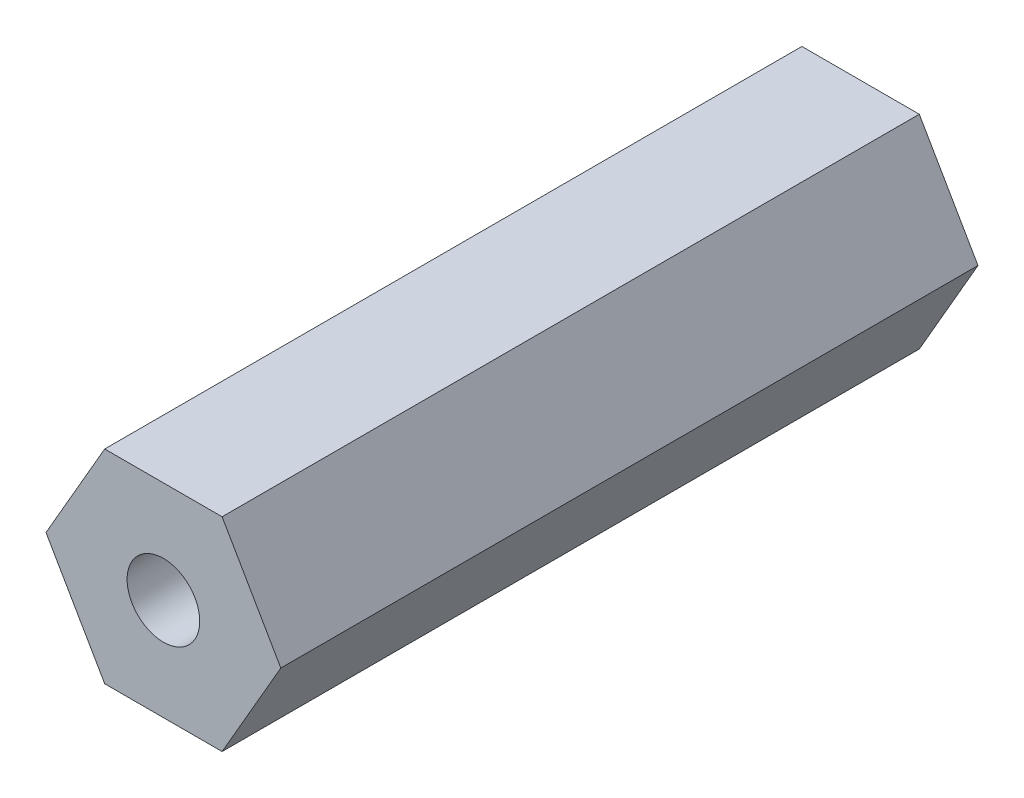
ISO-10303-21;
HEADER;
FILE_DESCRIPTION(('STEP AP214'),'2;1');
FILE_NAME('part.step','',(''),(''),'','','');
FILE_SCHEMA(('AUTOMOTIVE_DESIGN { 1 0 10303 214 1 1 1 1 }'));
ENDSEC;
DATA;
#1=APPLICATION_CONTEXT('core data for automotive mechanical design processes');
#2=APPLICATION_PROTOCOL_DEFINITION('international standard','automotive_design',2000,#1);
#3=PRODUCT_CONTEXT('',#1,'mechanical');
#4=PRODUCT('Part','Part','',(#3));
#5=PRODUCT_RELATED_PRODUCT_CATEGORY('part','',(#4));
#6=PRODUCT_DEFINITION_FORMATION('','',#4);
#7=PRODUCT_DEFINITION_CONTEXT('part definition',#1,'design');
#8=PRODUCT_DEFINITION('design','',#6,#7);
#9=PRODUCT_DEFINITION_SHAPE('','',#8);
#10=(LENGTH_UNIT() NAMED_UNIT(*) SI_UNIT(.MILLI.,.METRE.));
#11=(NAMED_UNIT(*) PLANE_ANGLE_UNIT() SI_UNIT($,.RADIAN.));
#12=(NAMED_UNIT(*) SI_UNIT($,.STERADIAN.) SOLID_ANGLE_UNIT());
#13=UNCERTAINTY_MEASURE_WITH_UNIT(LENGTH_MEASURE(1.E-05),#10,'distance_accuracy_value','');
#14=(GEOMETRIC_REPRESENTATION_CONTEXT(3) GLOBAL_UNCERTAINTY_ASSIGNED_CONTEXT((#13)) GLOBAL_UNIT_ASSIGNED_CONTEXT((#10,
#11,#12)) REPRESENTATION_CONTEXT('',''));
#15=CARTESIAN_POINT('',(0.,0.,0.));
#16=DIRECTION('',(0.,0.,1.));
#17=DIRECTION('',(1.,0.,0.));
#18=AXIS2_PLACEMENT_3D('',#15,#16,#17);
#19=CARTESIAN_POINT('',(2.0207259421637,-3.5,24.));
#20=DIRECTION('',(-0.866025403784439,0.5,0.));
#21=DIRECTION('',(-0.5,-0.866025403784439,0.));
#22=AXIS2_PLACEMENT_3D('',#19,#20,#21);
#23=PLANE('',#22);
#24=DIRECTION('',(0.5,0.866025403784439,0.));
#25=VECTOR('',#24,1.);
#26=CARTESIAN_POINT('',(2.0207259421637,-3.5,0.));
#27=LINE('',#26,#25);
#28=CARTESIAN_POINT('',(2.0207259421637,-3.5,0.));
#29=VERTEX_POINT('',#28);
#30=CARTESIAN_POINT('',(4.04145188432738,0.,0.));
#31=VERTEX_POINT('',#30);
#32=EDGE_CURVE('E126',#29,#31,#27,.T.);
#33=ORIENTED_EDGE('',*,*,#32,.T.);
#34=DIRECTION('',(0.,0.,-1.));
#35=VECTOR('',#34,1.);
#36=CARTESIAN_POINT('',(4.04145188432738,0.,24.));
#37=LINE('',#36,#35);
#38=CARTESIAN_POINT('',(4.04145188432738,0.,24.));
#39=VERTEX_POINT('',#38);
#40=EDGE_CURVE('E11',#39,#31,#37,.T.);
#41=ORIENTED_EDGE('',*,*,#40,.F.);
#42=DIRECTION('',(0.5,0.866025403784439,0.));
#43=VECTOR('',#42,1.);
#44=CARTESIAN_POINT('',(2.0207259421637,-3.5,24.));
#45=LINE('',#44,#43);
#46=CARTESIAN_POINT('',(2.0207259421637,-3.5,24.));
#47=VERTEX_POINT('',#46);
#48=EDGE_CURVE('E137',#47,#39,#45,.T.);
#49=ORIENTED_EDGE('',*,*,#48,.F.);
#50=DIRECTION('',(0.,0.,-1.));
#51=VECTOR('',#50,1.);
#52=CARTESIAN_POINT('',(2.0207259421637,-3.5,24.));
#53=LINE('',#52,#51);
#54=EDGE_CURVE('E122',#47,#29,#53,.T.);
#55=ORIENTED_EDGE('',*,*,#54,.T.);
#56=EDGE_LOOP('',(#33,#41,#49,#55));
#57=FACE_BOUND('',#56,.T.);
#58=ADVANCED_FACE('F39',(#57),#23,.F.);
#59=CARTESIAN_POINT('',(4.04145188432738,0.,24.));
#60=DIRECTION('',(-0.866025403784439,-0.5,0.));
#61=DIRECTION('',(0.5,-0.866025403784439,0.));
#62=AXIS2_PLACEMENT_3D('',#59,#60,#61);
#63=PLANE('',#62);
#64=DIRECTION('',(-0.5,0.866025403784439,0.));
#65=VECTOR('',#64,1.);
#66=CARTESIAN_POINT('',(4.04145188432738,0.,0.));
#67=LINE('',#66,#65);
#68=CARTESIAN_POINT('',(2.02072594216369,3.5,0.));
#69=VERTEX_POINT('',#68);
#70=EDGE_CURVE('E129',#31,#69,#67,.T.);
#71=ORIENTED_EDGE('',*,*,#70,.T.);
#72=DIRECTION('',(0.,0.,-1.));
#73=VECTOR('',#72,1.);
#74=CARTESIAN_POINT('',(2.02072594216369,3.5,24.));
#75=LINE('',#74,#73);
#76=CARTESIAN_POINT('',(2.02072594216369,3.5,24.));
#77=VERTEX_POINT('',#76);
#78=EDGE_CURVE('E47',#77,#69,#75,.T.);
#79=ORIENTED_EDGE('',*,*,#78,.F.);
#80=DIRECTION('',(-0.5,0.866025403784439,0.));
#81=VECTOR('',#80,1.);
#82=CARTESIAN_POINT('',(4.04145188432738,0.,24.));
#83=LINE('',#82,#81);
#84=EDGE_CURVE('E93',#39,#77,#83,.T.);
#85=ORIENTED_EDGE('',*,*,#84,.F.);
#86=ORIENTED_EDGE('',*,*,#40,.T.);
#87=EDGE_LOOP('',(#71,#79,#85,#86));
#88=FACE_BOUND('',#87,.T.);
#89=ADVANCED_FACE('F162',(#88),#63,.F.);
#90=CARTESIAN_POINT('',(2.02072594216369,3.5,24.));
#91=DIRECTION('',(0.,-1.,0.));
#92=DIRECTION('',(1.,0.,0.));
#93=AXIS2_PLACEMENT_3D('',#90,#91,#92);
#94=PLANE('',#93);
#95=DIRECTION('',(-1.,0.,0.));
#96=VECTOR('',#95,1.);
#97=CARTESIAN_POINT('',(2.02072594216369,3.5,0.));
#98=LINE('',#97,#96);
#99=CARTESIAN_POINT('',(-2.02072594216369,3.5,0.));
#100=VERTEX_POINT('',#99);
#101=EDGE_CURVE('E132',#69,#100,#98,.T.);
#102=ORIENTED_EDGE('',*,*,#101,.T.);
#103=DIRECTION('',(0.,0.,-1.));
#104=VECTOR('',#103,1.);
#105=CARTESIAN_POINT('',(-2.02072594216369,3.5,24.));
#106=LINE('',#105,#104);
#107=CARTESIAN_POINT('',(-2.02072594216369,3.5,24.));
#108=VERTEX_POINT('',#107);
#109=EDGE_CURVE('E117',#108,#100,#106,.T.);
#110=ORIENTED_EDGE('',*,*,#109,.F.);
#111=DIRECTION('',(-1.,0.,0.));
#112=VECTOR('',#111,1.);
#113=CARTESIAN_POINT('',(2.02072594216369,3.5,24.));
#114=LINE('',#113,#112);
#115=EDGE_CURVE('E108',#77,#108,#114,.T.);
#116=ORIENTED_EDGE('',*,*,#115,.F.);
#117=ORIENTED_EDGE('',*,*,#78,.T.);
#118=EDGE_LOOP('',(#102,#110,#116,#117));
#119=FACE_BOUND('',#118,.T.);
#120=ADVANCED_FACE('F143',(#119),#94,.F.);
#121=CARTESIAN_POINT('',(-2.02072594216369,3.5,24.));
#122=DIRECTION('',(0.866025403784439,-0.5,0.));
#123=DIRECTION('',(0.5,0.866025403784439,0.));
#124=AXIS2_PLACEMENT_3D('',#121,#122,#123);
#125=PLANE('',#124);
#126=DIRECTION('',(-0.5,-0.866025403784438,0.));
#127=VECTOR('',#126,1.);
#128=CARTESIAN_POINT('',(-2.02072594216369,3.5,0.));
#129=LINE('',#128,#127);
#130=CARTESIAN_POINT('',(-4.04145188432738,0.,0.));
#131=VERTEX_POINT('',#130);
#132=EDGE_CURVE('E116',#100,#131,#129,.T.);
#133=ORIENTED_EDGE('',*,*,#132,.T.);
#134=DIRECTION('',(0.,0.,-1.));
#135=VECTOR('',#134,1.);
#136=CARTESIAN_POINT('',(-4.04145188432738,0.,24.));
#137=LINE('',#136,#135);
#138=CARTESIAN_POINT('',(-4.04145188432738,0.,24.));
#139=VERTEX_POINT('',#138);
#140=EDGE_CURVE('E113',#139,#131,#137,.T.);
#141=ORIENTED_EDGE('',*,*,#140,.F.);
#142=DIRECTION('',(-0.5,-0.866025403784438,0.));
#143=VECTOR('',#142,1.);
#144=CARTESIAN_POINT('',(-2.02072594216369,3.5,24.));
#145=LINE('',#144,#143);
#146=EDGE_CURVE('E102',#108,#139,#145,.T.);
#147=ORIENTED_EDGE('',*,*,#146,.F.);
#148=ORIENTED_EDGE('',*,*,#109,.T.);
#149=EDGE_LOOP('',(#133,#141,#147,#148));
#150=FACE_BOUND('',#149,.T.);
#151=ADVANCED_FACE('F114',(#150),#125,.F.);
#152=CARTESIAN_POINT('',(-4.04145188432738,0.,24.));
#153=DIRECTION('',(0.866025403784439,0.5,0.));
#154=DIRECTION('',(-0.5,0.866025403784439,0.));
#155=AXIS2_PLACEMENT_3D('',#152,#153,#154);
#156=PLANE('',#155);
#157=DIRECTION('',(0.5,-0.866025403784439,0.));
#158=VECTOR('',#157,1.);
#159=CARTESIAN_POINT('',(-4.04145188432738,0.,0.));
#160=LINE('',#159,#158);
#161=CARTESIAN_POINT('',(-2.02072594216369,-3.5,0.));
#162=VERTEX_POINT('',#161);
#163=EDGE_CURVE('E79',#131,#162,#160,.T.);
#164=ORIENTED_EDGE('',*,*,#163,.T.);
#165=DIRECTION('',(0.,0.,-1.));
#166=VECTOR('',#165,1.);
#167=CARTESIAN_POINT('',(-2.02072594216369,-3.5,24.));
#168=LINE('',#167,#166);
#169=CARTESIAN_POINT('',(-2.02072594216369,-3.5,24.));
#170=VERTEX_POINT('',#169);
#171=EDGE_CURVE('E118',#170,#162,#168,.T.);
#172=ORIENTED_EDGE('',*,*,#171,.F.);
#173=DIRECTION('',(0.5,-0.866025403784439,0.));
#174=VECTOR('',#173,1.);
#175=CARTESIAN_POINT('',(-4.04145188432738,0.,24.));
#176=LINE('',#175,#174);
#177=EDGE_CURVE('E106',#139,#170,#176,.T.);
#178=ORIENTED_EDGE('',*,*,#177,.F.);
#179=ORIENTED_EDGE('',*,*,#140,.T.);
#180=EDGE_LOOP('',(#164,#172,#178,#179));
#181=FACE_BOUND('',#180,.T.);
#182=ADVANCED_FACE('F120',(#181),#156,.F.);
#183=CARTESIAN_POINT('',(-2.02072594216369,-3.5,24.));
#184=DIRECTION('',(0.,1.,0.));
#185=DIRECTION('',(-1.,0.,0.));
#186=AXIS2_PLACEMENT_3D('',#183,#184,#185);
#187=PLANE('',#186);
#188=DIRECTION('',(1.,0.,0.));
#189=VECTOR('',#188,1.);
#190=CARTESIAN_POINT('',(-2.02072594216369,-3.5,0.));
#191=LINE('',#190,#189);
#192=EDGE_CURVE('E85',#162,#29,#191,.T.);
#193=ORIENTED_EDGE('',*,*,#192,.T.);
#194=ORIENTED_EDGE('',*,*,#54,.F.);
#195=DIRECTION('',(1.,0.,0.));
#196=VECTOR('',#195,1.);
#197=CARTESIAN_POINT('',(-2.02072594216369,-3.5,24.));
#198=LINE('',#197,#196);
#199=EDGE_CURVE('E55',#170,#47,#198,.T.);
#200=ORIENTED_EDGE('',*,*,#199,.F.);
#201=ORIENTED_EDGE('',*,*,#171,.T.);
#202=EDGE_LOOP('',(#193,#194,#200,#201));
#203=FACE_BOUND('',#202,.T.);
#204=ADVANCED_FACE('F150',(#203),#187,.F.);
#205=CARTESIAN_POINT('',(0.,0.,24.));
#206=DIRECTION('',(0.,0.,1.));
#207=DIRECTION('',(1.,0.,0.));
#208=AXIS2_PLACEMENT_3D('',#205,#206,#207);
#209=PLANE('',#208);
#210=CARTESIAN_POINT('',(0.,0.,24.));
#211=DIRECTION('',(0.,0.,1.));
#212=DIRECTION('',(1.,0.,0.));
#213=AXIS2_PLACEMENT_3D('',#210,#211,#212);
#214=CIRCLE('',#213,1.24999999999999);
#215=CARTESIAN_POINT('',(1.24999999999999,0.,24.));
#216=VERTEX_POINT('',#215);
#217=EDGE_CURVE('E256',#216,#216,#214,.T.);
#218=ORIENTED_EDGE('',*,*,#217,.F.);
#219=EDGE_LOOP('',(#218));
#220=FACE_BOUND('',#219,.T.);
#221=ORIENTED_EDGE('',*,*,#48,.T.);
#222=ORIENTED_EDGE('',*,*,#84,.T.);
#223=ORIENTED_EDGE('',*,*,#115,.T.);
#224=ORIENTED_EDGE('',*,*,#146,.T.);
#225=ORIENTED_EDGE('',*,*,#177,.T.);
#226=ORIENTED_EDGE('',*,*,#199,.T.);
#227=EDGE_LOOP('',(#221,#222,#223,#224,#225,#226));
#228=FACE_BOUND('',#227,.T.);
#229=ADVANCED_FACE('F104',(#220,#228),#209,.T.);
#230=CARTESIAN_POINT('',(0.,0.,0.));
#231=DIRECTION('',(0.,0.,1.));
#232=DIRECTION('',(1.,0.,0.));
#233=AXIS2_PLACEMENT_3D('',#230,#231,#232);
#234=PLANE('',#233);
#235=CARTESIAN_POINT('',(0.,0.,0.));
#236=DIRECTION('',(0.,0.,-1.));
#237=DIRECTION('',(-1.,0.,0.));
#238=AXIS2_PLACEMENT_3D('',#235,#236,#237);
#239=CIRCLE('',#238,1.24999999999999);
#240=CARTESIAN_POINT('',(-1.24999999999999,0.,0.));
#241=VERTEX_POINT('',#240);
#242=EDGE_CURVE('E258',#241,#241,#239,.T.);
#243=ORIENTED_EDGE('',*,*,#242,.F.);
#244=EDGE_LOOP('',(#243));
#245=FACE_BOUND('',#244,.T.);
#246=ORIENTED_EDGE('',*,*,#32,.F.);
#247=ORIENTED_EDGE('',*,*,#192,.F.);
#248=ORIENTED_EDGE('',*,*,#163,.F.);
#249=ORIENTED_EDGE('',*,*,#132,.F.);
#250=ORIENTED_EDGE('',*,*,#101,.F.);
#251=ORIENTED_EDGE('',*,*,#70,.F.);
#252=EDGE_LOOP('',(#246,#247,#248,#249,#250,#251));
#253=FACE_BOUND('',#252,.T.);
#254=ADVANCED_FACE('F146',(#245,#253),#234,.F.);
#255=CARTESIAN_POINT('',(0.,0.,3.9));
#256=DIRECTION('',(0.,0.,-1.));
#257=DIRECTION('',(-1.,0.,0.));
#258=AXIS2_PLACEMENT_3D('',#255,#256,#257);
#259=CONICAL_SURFACE('',#258,1.25,1.02974425867665);
#260=CARTESIAN_POINT('',(0.,0.,4.65107577378445));
#261=VERTEX_POINT('',#260);
#262=VERTEX_LOOP('',#261);
#263=FACE_BOUND('',#262,.T.);
#264=CARTESIAN_POINT('',(0.,0.,3.9));
#265=DIRECTION('',(0.,0.,-1.));
#266=DIRECTION('',(-1.,0.,0.));
#267=AXIS2_PLACEMENT_3D('',#264,#265,#266);
#268=CIRCLE('',#267,1.25);
#269=CARTESIAN_POINT('',(-1.25,0.,3.9));
#270=VERTEX_POINT('',#269);
#271=EDGE_CURVE('E130',#270,#270,#268,.T.);
#272=ORIENTED_EDGE('',*,*,#271,.T.);
#273=EDGE_LOOP('',(#272));
#274=FACE_BOUND('',#273,.T.);
#275=ADVANCED_FACE('F194',(#263,#274),#259,.F.);
#276=CARTESIAN_POINT('',(0.,0.,0.));
#277=DIRECTION('',(0.,0.,-1.));
#278=DIRECTION('',(-1.,0.,0.));
#279=AXIS2_PLACEMENT_3D('',#276,#277,#278);
#280=CYLINDRICAL_SURFACE('',#279,1.24999999999999);
#281=ORIENTED_EDGE('',*,*,#271,.F.);
#282=EDGE_LOOP('',(#281));
#283=FACE_BOUND('',#282,.T.);
#284=ORIENTED_EDGE('',*,*,#242,.T.);
#285=EDGE_LOOP('',(#284));
#286=FACE_BOUND('',#285,.T.);
#287=ADVANCED_FACE('F203',(#283,#286),#280,.F.);
#288=CARTESIAN_POINT('',(0.,0.,20.1));
#289=DIRECTION('',(0.,0.,1.));
#290=DIRECTION('',(1.,0.,0.));
#291=AXIS2_PLACEMENT_3D('',#288,#289,#290);
#292=CONICAL_SURFACE('',#291,1.24999999999999,1.02974425867665);
#293=CARTESIAN_POINT('',(0.,0.,19.3489242262156));
#294=VERTEX_POINT('',#293);
#295=VERTEX_LOOP('',#294);
#296=FACE_BOUND('',#295,.T.);
#297=CARTESIAN_POINT('',(0.,0.,20.1));
#298=DIRECTION('',(0.,0.,1.));
#299=DIRECTION('',(1.,0.,0.));
#300=AXIS2_PLACEMENT_3D('',#297,#298,#299);
#301=CIRCLE('',#300,1.24999999999999);
#302=CARTESIAN_POINT('',(1.24999999999999,0.,20.1));
#303=VERTEX_POINT('',#302);
#304=EDGE_CURVE('E253',#303,#303,#301,.T.);
#305=ORIENTED_EDGE('',*,*,#304,.T.);
#306=EDGE_LOOP('',(#305));
#307=FACE_BOUND('',#306,.T.);
#308=ADVANCED_FACE('F214',(#296,#307),#292,.F.);
#309=CARTESIAN_POINT('',(0.,0.,24.));
#310=DIRECTION('',(0.,0.,1.));
#311=DIRECTION('',(1.,0.,0.));
#312=AXIS2_PLACEMENT_3D('',#309,#310,#311);
#313=CYLINDRICAL_SURFACE('',#312,1.24999999999999);
#314=ORIENTED_EDGE('',*,*,#304,.F.);
#315=EDGE_LOOP('',(#314));
#316=FACE_BOUND('',#315,.T.);
#317=ORIENTED_EDGE('',*,*,#217,.T.);
#318=EDGE_LOOP('',(#317));
#319=FACE_BOUND('',#318,.T.);
#320=ADVANCED_FACE('F231',(#316,#319),#313,.F.);
#321=CLOSED_SHELL('',(#58,#89,#120,#151,#182,#204,#229,#254,#275,#287,#308,#320));
#322=MANIFOLD_SOLID_BREP('B2',#321);
#323=ADVANCED_BREP_SHAPE_REPRESENTATION('',(#18,#322),#14);
#324=SHAPE_DEFINITION_REPRESENTATION(#9,#323);
ENDSEC;
END-ISO-10303-21;
